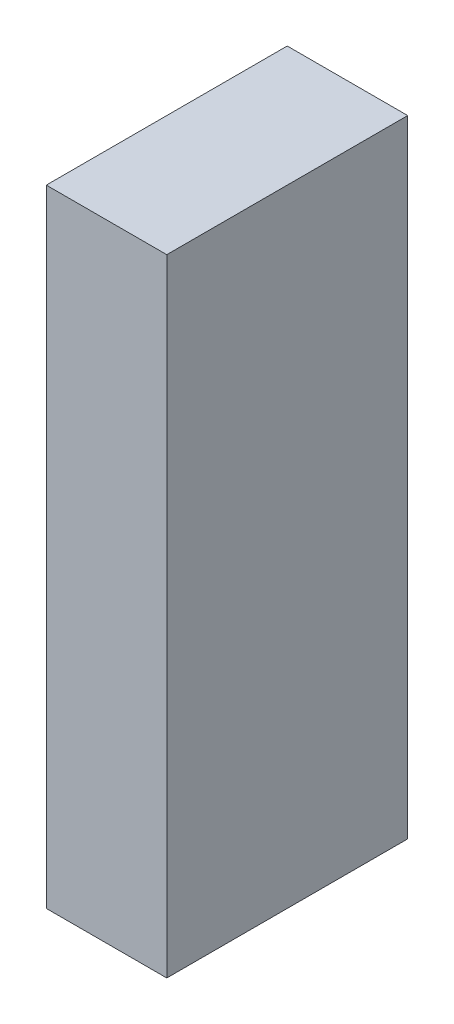
ISO-10303-21;
HEADER;
FILE_DESCRIPTION(('STEP AP214'),'2;1');
FILE_NAME('part.step','',(''),(''),'','','');
FILE_SCHEMA(('AUTOMOTIVE_DESIGN { 1 0 10303 214 1 1 1 1 }'));
ENDSEC;
DATA;
#1=APPLICATION_CONTEXT('core data for automotive mechanical design processes');
#2=APPLICATION_PROTOCOL_DEFINITION('international standard','automotive_design',2000,#1);
#3=PRODUCT_CONTEXT('',#1,'mechanical');
#4=PRODUCT('Part','Part','',(#3));
#5=PRODUCT_RELATED_PRODUCT_CATEGORY('part','',(#4));
#6=PRODUCT_DEFINITION_FORMATION('','',#4);
#7=PRODUCT_DEFINITION_CONTEXT('part definition',#1,'design');
#8=PRODUCT_DEFINITION('design','',#6,#7);
#9=PRODUCT_DEFINITION_SHAPE('','',#8);
#10=(LENGTH_UNIT() NAMED_UNIT(*) SI_UNIT(.MILLI.,.METRE.));
#11=(NAMED_UNIT(*) PLANE_ANGLE_UNIT() SI_UNIT($,.RADIAN.));
#12=(NAMED_UNIT(*) SI_UNIT($,.STERADIAN.) SOLID_ANGLE_UNIT());
#13=UNCERTAINTY_MEASURE_WITH_UNIT(LENGTH_MEASURE(1.E-05),#10,'distance_accuracy_value','');
#14=(GEOMETRIC_REPRESENTATION_CONTEXT(3) GLOBAL_UNCERTAINTY_ASSIGNED_CONTEXT((#13)) GLOBAL_UNIT_ASSIGNED_CONTEXT((#10,
#11,#12)) REPRESENTATION_CONTEXT('',''));
#15=CARTESIAN_POINT('',(0.,0.,0.));
#16=DIRECTION('',(0.,0.,1.));
#17=DIRECTION('',(1.,0.,0.));
#18=AXIS2_PLACEMENT_3D('',#15,#16,#17);
#19=CARTESIAN_POINT('',(-0.12499848,-0.65000124,0.));
#20=DIRECTION('',(-1.,0.,0.));
#21=DIRECTION('',(0.,0.,1.));
#22=AXIS2_PLACEMENT_3D('',#19,#20,#21);
#23=PLANE('',#22);
#24=DIRECTION('',(0.,0.,1.));
#25=VECTOR('',#24,1.);
#26=CARTESIAN_POINT('',(-0.12499848,0.65000124,0.));
#27=LINE('',#26,#25);
#28=CARTESIAN_POINT('',(-0.12499848,0.65000124,0.));
#29=VERTEX_POINT('',#28);
#30=CARTESIAN_POINT('',(-0.12499848,0.65000124,0.499999));
#31=VERTEX_POINT('',#30);
#32=EDGE_CURVE('E20',#29,#31,#27,.T.);
#33=ORIENTED_EDGE('',*,*,#32,.F.);
#34=DIRECTION('',(0.,1.,0.));
#35=VECTOR('',#34,1.);
#36=CARTESIAN_POINT('',(-0.12499848,0.65000124,0.));
#37=LINE('',#36,#35);
#38=CARTESIAN_POINT('',(-0.12499848,-0.65000124,0.));
#39=VERTEX_POINT('',#38);
#40=EDGE_CURVE('E80',#29,#39,#37,.F.);
#41=ORIENTED_EDGE('',*,*,#40,.T.);
#42=DIRECTION('',(0.,0.,-1.));
#43=VECTOR('',#42,1.);
#44=CARTESIAN_POINT('',(-0.12499848,-0.65000124,0.));
#45=LINE('',#44,#43);
#46=CARTESIAN_POINT('',(-0.12499848,-0.65000124,0.499999));
#47=VERTEX_POINT('',#46);
#48=EDGE_CURVE('E68',#47,#39,#45,.T.);
#49=ORIENTED_EDGE('',*,*,#48,.F.);
#50=DIRECTION('',(0.,1.,0.));
#51=VECTOR('',#50,1.);
#52=CARTESIAN_POINT('',(-0.12499848,0.65000124,0.499999));
#53=LINE('',#52,#51);
#54=EDGE_CURVE('E56',#31,#47,#53,.F.);
#55=ORIENTED_EDGE('',*,*,#54,.F.);
#56=EDGE_LOOP('',(#33,#41,#49,#55));
#57=FACE_BOUND('',#56,.T.);
#58=ADVANCED_FACE('F17',(#57),#23,.T.);
#59=CARTESIAN_POINT('',(-0.12499848,0.65000124,0.));
#60=DIRECTION('',(0.,1.,0.));
#61=DIRECTION('',(0.,0.,1.));
#62=AXIS2_PLACEMENT_3D('',#59,#60,#61);
#63=PLANE('',#62);
#64=DIRECTION('',(0.,0.,-1.));
#65=VECTOR('',#64,1.);
#66=CARTESIAN_POINT('',(0.12500102,0.65000124,0.));
#67=LINE('',#66,#65);
#68=CARTESIAN_POINT('',(0.12500102,0.65000124,0.));
#69=VERTEX_POINT('',#68);
#70=CARTESIAN_POINT('',(0.12500102,0.65000124,0.499999));
#71=VERTEX_POINT('',#70);
#72=EDGE_CURVE('E83',#69,#71,#67,.F.);
#73=ORIENTED_EDGE('',*,*,#72,.F.);
#74=DIRECTION('',(1.,0.,0.));
#75=VECTOR('',#74,1.);
#76=CARTESIAN_POINT('',(0.12500102,0.65000124,0.));
#77=LINE('',#76,#75);
#78=EDGE_CURVE('E65',#69,#29,#77,.F.);
#79=ORIENTED_EDGE('',*,*,#78,.T.);
#80=ORIENTED_EDGE('',*,*,#32,.T.);
#81=DIRECTION('',(1.,0.,0.));
#82=VECTOR('',#81,1.);
#83=CARTESIAN_POINT('',(0.12500102,0.65000124,0.499999));
#84=LINE('',#83,#82);
#85=EDGE_CURVE('E62',#71,#31,#84,.F.);
#86=ORIENTED_EDGE('',*,*,#85,.F.);
#87=EDGE_LOOP('',(#73,#79,#80,#86));
#88=FACE_BOUND('',#87,.T.);
#89=ADVANCED_FACE('F61',(#88),#63,.T.);
#90=CARTESIAN_POINT('',(0.12500102,0.65000124,0.499999));
#91=DIRECTION('',(0.,0.,1.));
#92=DIRECTION('',(1.,0.,0.));
#93=AXIS2_PLACEMENT_3D('',#90,#91,#92);
#94=PLANE('',#93);
#95=DIRECTION('',(1.,0.,0.));
#96=VECTOR('',#95,1.);
#97=CARTESIAN_POINT('',(0.12500102,-0.65000124,0.499999));
#98=LINE('',#97,#96);
#99=CARTESIAN_POINT('',(0.12500102,-0.65000124,0.499999));
#100=VERTEX_POINT('',#99);
#101=EDGE_CURVE('E70',#100,#47,#98,.F.);
#102=ORIENTED_EDGE('',*,*,#101,.F.);
#103=DIRECTION('',(0.,1.,0.));
#104=VECTOR('',#103,1.);
#105=CARTESIAN_POINT('',(0.12500102,0.65000124,0.499999));
#106=LINE('',#105,#104);
#107=EDGE_CURVE('E74',#71,#100,#106,.F.);
#108=ORIENTED_EDGE('',*,*,#107,.F.);
#109=ORIENTED_EDGE('',*,*,#85,.T.);
#110=ORIENTED_EDGE('',*,*,#54,.T.);
#111=EDGE_LOOP('',(#102,#108,#109,#110));
#112=FACE_BOUND('',#111,.T.);
#113=ADVANCED_FACE('F72',(#112),#94,.T.);
#114=CARTESIAN_POINT('',(0.12500102,-0.65000124,0.));
#115=DIRECTION('',(0.,-1.,0.));
#116=DIRECTION('',(0.,0.,-1.));
#117=AXIS2_PLACEMENT_3D('',#114,#115,#116);
#118=PLANE('',#117);
#119=ORIENTED_EDGE('',*,*,#48,.T.);
#120=DIRECTION('',(1.,0.,0.));
#121=VECTOR('',#120,1.);
#122=CARTESIAN_POINT('',(0.12500102,-0.65000124,0.));
#123=LINE('',#122,#121);
#124=CARTESIAN_POINT('',(0.12500102,-0.65000124,0.));
#125=VERTEX_POINT('',#124);
#126=EDGE_CURVE('E35',#39,#125,#123,.T.);
#127=ORIENTED_EDGE('',*,*,#126,.T.);
#128=DIRECTION('',(0.,0.,-1.));
#129=VECTOR('',#128,1.);
#130=CARTESIAN_POINT('',(0.12500102,-0.65000124,0.));
#131=LINE('',#130,#129);
#132=EDGE_CURVE('E26',#100,#125,#131,.T.);
#133=ORIENTED_EDGE('',*,*,#132,.F.);
#134=ORIENTED_EDGE('',*,*,#101,.T.);
#135=EDGE_LOOP('',(#119,#127,#133,#134));
#136=FACE_BOUND('',#135,.T.);
#137=ADVANCED_FACE('F89',(#136),#118,.T.);
#138=CARTESIAN_POINT('',(0.12500102,0.65000124,0.));
#139=DIRECTION('',(0.,0.,1.));
#140=DIRECTION('',(1.,0.,0.));
#141=AXIS2_PLACEMENT_3D('',#138,#139,#140);
#142=PLANE('',#141);
#143=ORIENTED_EDGE('',*,*,#126,.F.);
#144=ORIENTED_EDGE('',*,*,#40,.F.);
#145=ORIENTED_EDGE('',*,*,#78,.F.);
#146=DIRECTION('',(0.,1.,0.));
#147=VECTOR('',#146,1.);
#148=CARTESIAN_POINT('',(0.12500102,0.65000124,0.));
#149=LINE('',#148,#147);
#150=EDGE_CURVE('E11',#125,#69,#149,.T.);
#151=ORIENTED_EDGE('',*,*,#150,.F.);
#152=EDGE_LOOP('',(#143,#144,#145,#151));
#153=FACE_BOUND('',#152,.T.);
#154=ADVANCED_FACE('F91',(#153),#142,.F.);
#155=CARTESIAN_POINT('',(0.12500102,0.65000124,0.));
#156=DIRECTION('',(1.,0.,0.));
#157=DIRECTION('',(0.,0.,-1.));
#158=AXIS2_PLACEMENT_3D('',#155,#156,#157);
#159=PLANE('',#158);
#160=ORIENTED_EDGE('',*,*,#132,.T.);
#161=ORIENTED_EDGE('',*,*,#150,.T.);
#162=ORIENTED_EDGE('',*,*,#72,.T.);
#163=ORIENTED_EDGE('',*,*,#107,.T.);
#164=EDGE_LOOP('',(#160,#161,#162,#163));
#165=FACE_BOUND('',#164,.T.);
#166=ADVANCED_FACE('F88',(#165),#159,.T.);
#167=CLOSED_SHELL('',(#58,#89,#113,#137,#154,#166));
#168=MANIFOLD_SOLID_BREP('B1',#167);
#169=ADVANCED_BREP_SHAPE_REPRESENTATION('',(#18,#168),#14);
#170=SHAPE_DEFINITION_REPRESENTATION(#9,#169);
ENDSEC;
END-ISO-10303-21;
